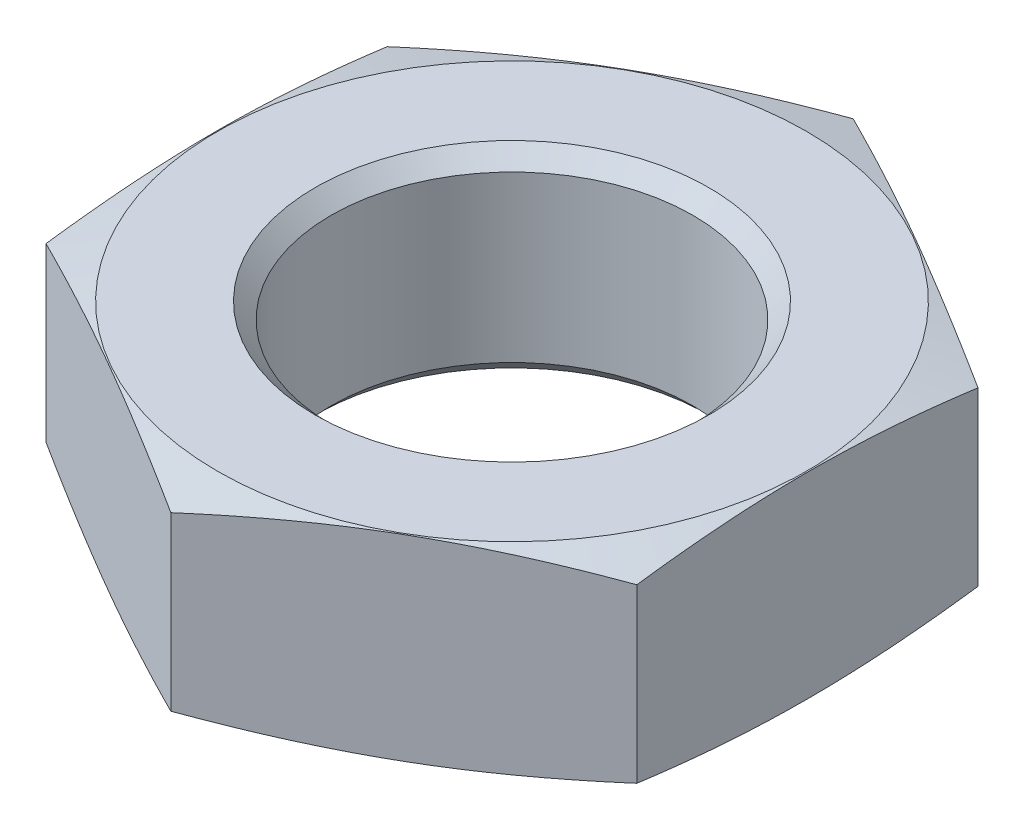
ISO-10303-21;
HEADER;
FILE_DESCRIPTION(('STEP AP214'),'2;1');
FILE_NAME('part.step','',(''),(''),'','','');
FILE_SCHEMA(('AUTOMOTIVE_DESIGN { 1 0 10303 214 1 1 1 1 }'));
ENDSEC;
DATA;
#1=APPLICATION_CONTEXT('core data for automotive mechanical design processes');
#2=APPLICATION_PROTOCOL_DEFINITION('international standard','automotive_design',2000,#1);
#3=PRODUCT_CONTEXT('',#1,'mechanical');
#4=PRODUCT('Part','Part','',(#3));
#5=PRODUCT_RELATED_PRODUCT_CATEGORY('part','',(#4));
#6=PRODUCT_DEFINITION_FORMATION('','',#4);
#7=PRODUCT_DEFINITION_CONTEXT('part definition',#1,'design');
#8=PRODUCT_DEFINITION('design','',#6,#7);
#9=PRODUCT_DEFINITION_SHAPE('','',#8);
#10=(LENGTH_UNIT() NAMED_UNIT(*) SI_UNIT(.MILLI.,.METRE.));
#11=(NAMED_UNIT(*) PLANE_ANGLE_UNIT() SI_UNIT($,.RADIAN.));
#12=(NAMED_UNIT(*) SI_UNIT($,.STERADIAN.) SOLID_ANGLE_UNIT());
#13=UNCERTAINTY_MEASURE_WITH_UNIT(LENGTH_MEASURE(1.E-05),#10,'distance_accuracy_value','');
#14=(GEOMETRIC_REPRESENTATION_CONTEXT(3) GLOBAL_UNCERTAINTY_ASSIGNED_CONTEXT((#13)) GLOBAL_UNIT_ASSIGNED_CONTEXT((#10,
#11,#12)) REPRESENTATION_CONTEXT('',''));
#15=CARTESIAN_POINT('',(0.,0.,0.));
#16=DIRECTION('',(0.,0.,1.));
#17=DIRECTION('',(1.,0.,0.));
#18=AXIS2_PLACEMENT_3D('',#15,#16,#17);
#19=CARTESIAN_POINT('',(0.,-5.,0.));
#20=DIRECTION('',(0.,-1.,0.));
#21=DIRECTION('',(0.,0.,-1.));
#22=AXIS2_PLACEMENT_3D('',#19,#20,#21);
#23=CONICAL_SURFACE('',#22,33.610254037844,1.30899693899574);
#24=CARTESIAN_POINT('',(0.,0.,0.));
#25=DIRECTION('',(0.,-1.,0.));
#26=DIRECTION('',(0.,0.,-1.));
#27=AXIS2_PLACEMENT_3D('',#24,#25,#26);
#28=CIRCLE('',#27,14.95);
#29=CARTESIAN_POINT('',(0.,0.,-14.95));
#30=VERTEX_POINT('',#29);
#31=EDGE_CURVE('E121',#30,#30,#28,.T.);
#32=ORIENTED_EDGE('',*,*,#31,.T.);
#33=EDGE_LOOP('',(#32));
#34=FACE_BOUND('',#33,.T.);
#35=CARTESIAN_POINT('',(0.000200000000000056,-0.635206664949411,-17.3206235457428));
#36=CARTESIAN_POINT('',(-0.622728932700655,-0.538800827945986,-16.9609753587621));
#37=CARTESIAN_POINT('',(-1.24678727017876,-0.451280393314875,-16.6006751096291));
#38=CARTESIAN_POINT('',(-2.49710774889726,-0.29751538584662,-15.8788022446676));
#39=CARTESIAN_POINT('',(-3.12337068110035,-0.231279453936855,-15.5172291721767));
#40=CARTESIAN_POINT('',(-4.37430350543358,-0.123950090522062,-14.7950027693097));
#41=CARTESIAN_POINT('',(-4.99896493964763,-0.0827286703296778,-14.4343543221139));
#42=CARTESIAN_POINT('',(-6.2490843675985,-0.0274549828941479,-13.7125975338672));
#43=CARTESIAN_POINT('',(-6.87454218379925,-0.0133974596215881,-13.351489295317));
#44=CARTESIAN_POINT('',(-8.12545781620075,-0.0133974596215824,-12.6292728182164));
#45=CARTESIAN_POINT('',(-8.75091563240149,-0.0274549828941366,-12.2681645796662));
#46=CARTESIAN_POINT('',(-10.0010350603524,-0.0827286703296557,-11.5464077914195));
#47=CARTESIAN_POINT('',(-10.6256964945664,-0.123950090522035,-11.1857593442237));
#48=CARTESIAN_POINT('',(-11.8766293188996,-0.231279453936818,-10.4635329413567));
#49=CARTESIAN_POINT('',(-12.5028922511027,-0.297515385846577,-10.1019598688658));
#50=CARTESIAN_POINT('',(-13.7532127298212,-0.451280393314823,-9.38008700390433));
#51=CARTESIAN_POINT('',(-14.3772710672993,-0.53880082794593,-9.0197867547713));
#52=CARTESIAN_POINT('',(-15.0002,-0.635206664949352,-8.66013856779056));
#53=B_SPLINE_CURVE_WITH_KNOTS('',3,(#35,#36,#37,#38,#39,#40,#41,#42,#43,#44,#45,#46,#47,#48,#49,
#50,#51,#52),.UNSPECIFIED.,.F.,.F.,(4,2,2,2,2,2,2,2,4),(0.,2.17729853341998,4.35547987718866,
6.52242029514905,8.68894138286617,10.8554624705833,13.0224028885437,15.2005842323124,
17.3778827657323),.UNSPECIFIED.);
#54=CARTESIAN_POINT('',(0.,-0.635175724532333,-17.320508075689));
#55=VERTEX_POINT('',#54);
#56=CARTESIAN_POINT('',(-15.,-0.635175724532275,-8.6602540378444));
#57=VERTEX_POINT('',#56);
#58=EDGE_CURVE('E117',#55,#57,#53,.T.);
#59=ORIENTED_EDGE('',*,*,#58,.T.);
#60=CARTESIAN_POINT('',(-15.,-4.19734686145317,-26.6882104151644));
#61=CARTESIAN_POINT('',(-15.,-4.04728237957778,-26.0456775069698));
#62=CARTESIAN_POINT('',(-15.,-3.89841376208704,-25.4028625682647));
#63=CARTESIAN_POINT('',(-15.,-3.60361331633755,-24.1165495457866));
#64=CARTESIAN_POINT('',(-15.,-3.45768153375547,-23.4730514515519));
#65=CARTESIAN_POINT('',(-15.,-3.16927895018258,-22.1851588287416));
#66=CARTESIAN_POINT('',(-15.,-3.02680876745556,-21.5407641614482));
#67=CARTESIAN_POINT('',(-15.,-2.74607458738785,-20.2510596723885));
#68=CARTESIAN_POINT('',(-15.,-2.60781057691053,-19.605749853487));
#69=CARTESIAN_POINT('',(-15.,-2.33504512118306,-18.3077216695585));
#70=CARTESIAN_POINT('',(-15.,-2.20059388847709,-17.6549927253798));
#71=CARTESIAN_POINT('',(-15.,-1.93803441364996,-16.348254444997));
#72=CARTESIAN_POINT('',(-15.,-1.80992618679957,-15.6942451057142));
#73=CARTESIAN_POINT('',(-15.,-1.56147605534191,-14.3846693484919));
#74=CARTESIAN_POINT('',(-15.,-1.44113503722143,-13.7291027616423));
#75=CARTESIAN_POINT('',(-15.,-1.21001623344559,-12.4162761806663));
#76=CARTESIAN_POINT('',(-15.,-1.09923844463331,-11.7590161870991));
#77=CARTESIAN_POINT('',(-15.,-0.892302321740734,-10.4607522997781));
#78=CARTESIAN_POINT('',(-15.,-0.795825238468954,-9.819799562115));
#79=CARTESIAN_POINT('',(-15.,-0.616291631949564,-8.53599965014025));
#80=CARTESIAN_POINT('',(-15.,-0.533235112731352,-7.89315247525991));
#81=CARTESIAN_POINT('',(-15.,-0.383133589787474,-6.60574537953739));
#82=CARTESIAN_POINT('',(-15.,-0.316084281466315,-5.96118596639323));
#83=CARTESIAN_POINT('',(-15.,-0.2005588921417,-4.67038988333616));
#84=CARTESIAN_POINT('',(-15.,-0.152082560600824,-4.02415323616645));
#85=CARTESIAN_POINT('',(-15.,-0.0761180684616546,-2.73338911847361));
#86=CARTESIAN_POINT('',(-15.,-0.0485350726589694,-2.08886731965157));
#87=CARTESIAN_POINT('',(-15.,-0.0154243686231671,-0.799251571457375));
#88=CARTESIAN_POINT('',(-15.,-0.00989652534641193,-0.154157625612663));
#89=CARTESIAN_POINT('',(-15.,-0.0212012472705901,1.13587343404143));
#90=CARTESIAN_POINT('',(-15.,-0.0380352393381742,1.78081053521643));
#91=CARTESIAN_POINT('',(-15.,-0.0931531405870201,3.06974525131756));
#92=CARTESIAN_POINT('',(-15.,-0.131437035434169,3.71374286687122));
#93=CARTESIAN_POINT('',(-15.,-0.249239500101832,5.28978420404424));
#94=CARTESIAN_POINT('',(-15.,-0.339561614299427,6.22102068218273));
#95=CARTESIAN_POINT('',(-15.,-0.553803128138935,8.07947744819296));
#96=CARTESIAN_POINT('',(-15.,-0.677721798777665,9.00669782276562));
#97=CARTESIAN_POINT('',(-15.,-0.951932633784524,10.8603845088264));
#98=CARTESIAN_POINT('',(-15.,-1.10231282697987,11.786837595432));
#99=CARTESIAN_POINT('',(-15.,-1.42269864392773,13.636289263484));
#100=CARTESIAN_POINT('',(-15.,-1.59270402317841,14.5592878878204));
#101=CARTESIAN_POINT('',(-15.,-1.95116249047242,16.4220380388751));
#102=CARTESIAN_POINT('',(-15.,-2.13993101489592,17.3617283910909));
#103=CARTESIAN_POINT('',(-15.,-2.52890919838184,19.2387360556124));
#104=CARTESIAN_POINT('',(-15.,-2.72911900124019,20.1760533379382));
#105=CARTESIAN_POINT('',(-15.,-3.1370044972446,22.0433826497276));
#106=CARTESIAN_POINT('',(-15.,-3.34463037516154,22.9734055987705));
#107=CARTESIAN_POINT('',(-15.,-3.66099034394533,24.3672843884216));
#108=CARTESIAN_POINT('',(-15.,-3.76726012093449,24.8317021000828));
#109=CARTESIAN_POINT('',(-15.,-3.9812567862345,25.7601995400648));
#110=CARTESIAN_POINT('',(-15.,-4.08898366782203,26.2242792699348));
#111=CARTESIAN_POINT('',(-15.,-4.19734686145317,26.6882104151644));
#112=B_SPLINE_CURVE_WITH_KNOTS('',3,(#60,#61,#62,#63,#64,#65,#66,#67,#68,#69,#70,#71,#72,#73,
#74,#75,#76,#77,#78,#79,#80,#81,#82,#83,#84,#85,#86,#87,#88,#89,#90,#91,#92,#93,#94,#95,#96,#97,
#98,#99,#100,#101,#102,#103,#104,#105,#106,#107,#108,#109,#110,#111),.UNSPECIFIED.,.F.,.F.,(4,2,
2,2,2,2,2,2,2,2,2,2,2,2,2,2,2,2,2,2,2,2,2,2,2,4),(0.,1.97947523238895,3.95898122786014,
5.93883821473682,7.9186890175283,9.91796086950209,11.9172375344847,13.9167419788133,
15.9162457630806,17.8606482285009,19.8050512777089,21.748930855315,23.6927842103219,
25.6277606188558,27.5627251795162,29.4978132125565,31.4328999524564,34.2388983241575,
37.0448358140818,39.8602905717607,42.6757102566727,45.5510054442523,48.4263367769824,
51.2850564287586,52.7143179876363,54.1435729538964),.UNSPECIFIED.);
#113=CARTESIAN_POINT('',(-15.,-0.635175724532275,8.6602540378444));
#114=VERTEX_POINT('',#113);
#115=EDGE_CURVE('E110',#57,#114,#112,.T.);
#116=ORIENTED_EDGE('',*,*,#115,.T.);
#117=CARTESIAN_POINT('',(-15.0002,-0.635206664949351,8.66013856779056));
#118=CARTESIAN_POINT('',(-14.3772710672993,-0.53880082794593,9.0197867547713));
#119=CARTESIAN_POINT('',(-13.7532127298212,-0.451280393314824,9.38008700390433));
#120=CARTESIAN_POINT('',(-12.5028922511027,-0.297515385846578,10.1019598688658));
#121=CARTESIAN_POINT('',(-11.8766293188996,-0.231279453936818,10.4635329413567));
#122=CARTESIAN_POINT('',(-10.6256964945664,-0.123950090522035,11.1857593442237));
#123=CARTESIAN_POINT('',(-10.0010350603524,-0.0827286703296557,11.5464077914195));
#124=CARTESIAN_POINT('',(-8.7509156324015,-0.0274549828941366,12.2681645796662));
#125=CARTESIAN_POINT('',(-8.12545781620075,-0.0133974596215823,12.6292728182164));
#126=CARTESIAN_POINT('',(-6.87454218379925,-0.0133974596215877,13.351489295317));
#127=CARTESIAN_POINT('',(-6.2490843675985,-0.0274549828941473,13.7125975338672));
#128=CARTESIAN_POINT('',(-4.99896493964764,-0.0827286703296775,14.4343543221139));
#129=CARTESIAN_POINT('',(-4.37430350543358,-0.123950090522062,14.7950027693097));
#130=CARTESIAN_POINT('',(-3.12337068110035,-0.231279453936855,15.5172291721767));
#131=CARTESIAN_POINT('',(-2.49710774889727,-0.297515385846619,15.8788022446676));
#132=CARTESIAN_POINT('',(-1.24678727017876,-0.451280393314873,16.6006751096291));
#133=CARTESIAN_POINT('',(-0.622728932700655,-0.538800827945984,16.9609753587621));
#134=CARTESIAN_POINT('',(0.000199999999999267,-0.635206664949409,17.3206235457428));
#135=B_SPLINE_CURVE_WITH_KNOTS('',3,(#117,#118,#119,#120,#121,#122,#123,#124,#125,#126,#127,
#128,#129,#130,#131,#132,#133,#134),.UNSPECIFIED.,.F.,.F.,(4,2,2,2,2,2,2,2,4),(0.,
2.17729853341998,4.35547987718866,6.52242029514905,8.68894138286617,10.8554624705833,
13.0224028885437,15.2005842323124,17.3778827657323),.UNSPECIFIED.);
#136=CARTESIAN_POINT('',(0.,-0.635175724532335,17.320508075689));
#137=VERTEX_POINT('',#136);
#138=EDGE_CURVE('E99',#114,#137,#135,.T.);
#139=ORIENTED_EDGE('',*,*,#138,.T.);
#140=CARTESIAN_POINT('',(-0.000200000000000798,-0.635206664949411,17.3206235457428));
#141=CARTESIAN_POINT('',(0.622728932700653,-0.538800827945984,16.9609753587621));
#142=CARTESIAN_POINT('',(1.24678727017876,-0.451280393314873,16.6006751096291));
#143=CARTESIAN_POINT('',(2.49710774889726,-0.297515385846619,15.8788022446676));
#144=CARTESIAN_POINT('',(3.12337068110035,-0.231279453936855,15.5172291721767));
#145=CARTESIAN_POINT('',(4.37430350543358,-0.123950090522062,14.7950027693097));
#146=CARTESIAN_POINT('',(4.99896493964763,-0.0827286703296774,14.4343543221139));
#147=CARTESIAN_POINT('',(6.2490843675985,-0.0274549828941471,13.7125975338672));
#148=CARTESIAN_POINT('',(6.87454218379925,-0.0133974596215877,13.351489295317));
#149=CARTESIAN_POINT('',(8.12545781620075,-0.0133974596215821,12.6292728182164));
#150=CARTESIAN_POINT('',(8.7509156324015,-0.027454982894136,12.2681645796662));
#151=CARTESIAN_POINT('',(10.0010350603524,-0.0827286703296551,11.5464077914195));
#152=CARTESIAN_POINT('',(10.6256964945664,-0.123950090522034,11.1857593442237));
#153=CARTESIAN_POINT('',(11.8766293188996,-0.231279453936818,10.4635329413567));
#154=CARTESIAN_POINT('',(12.5028922511027,-0.297515385846577,10.1019598688658));
#155=CARTESIAN_POINT('',(13.7532127298212,-0.451280393314823,9.38008700390433));
#156=CARTESIAN_POINT('',(14.3772710672993,-0.53880082794593,9.0197867547713));
#157=CARTESIAN_POINT('',(15.0002,-0.635206664949352,8.66013856779056));
#158=B_SPLINE_CURVE_WITH_KNOTS('',3,(#140,#141,#142,#143,#144,#145,#146,#147,#148,#149,#150,
#151,#152,#153,#154,#155,#156,#157),.UNSPECIFIED.,.F.,.F.,(4,2,2,2,2,2,2,2,4),(0.,
2.17729853341998,4.35547987718866,6.52242029514905,8.68894138286617,10.8554624705833,
13.0224028885437,15.2005842323124,17.3778827657323),.UNSPECIFIED.);
#159=CARTESIAN_POINT('',(15.,-0.635175724532275,8.6602540378444));
#160=VERTEX_POINT('',#159);
#161=EDGE_CURVE('E104',#137,#160,#158,.T.);
#162=ORIENTED_EDGE('',*,*,#161,.T.);
#163=CARTESIAN_POINT('',(15.,-4.19734686145317,26.6882104151644));
#164=CARTESIAN_POINT('',(15.,-4.04728237957778,26.0456775069698));
#165=CARTESIAN_POINT('',(15.,-3.89841376208704,25.4028625682647));
#166=CARTESIAN_POINT('',(15.,-3.60361331633755,24.1165495457866));
#167=CARTESIAN_POINT('',(15.,-3.45768153375547,23.4730514515519));
#168=CARTESIAN_POINT('',(15.,-3.16927895018258,22.1851588287416));
#169=CARTESIAN_POINT('',(15.,-3.02680876745556,21.5407641614482));
#170=CARTESIAN_POINT('',(15.,-2.74607458738785,20.2510596723885));
#171=CARTESIAN_POINT('',(15.,-2.60781057691053,19.605749853487));
#172=CARTESIAN_POINT('',(15.,-2.33504512118306,18.3077216695585));
#173=CARTESIAN_POINT('',(15.,-2.20059388847709,17.6549927253798));
#174=CARTESIAN_POINT('',(15.,-1.93803441364996,16.348254444997));
#175=CARTESIAN_POINT('',(15.,-1.80992618679957,15.6942451057142));
#176=CARTESIAN_POINT('',(15.,-1.56147605534191,14.3846693484919));
#177=CARTESIAN_POINT('',(15.,-1.44113503722143,13.7291027616423));
#178=CARTESIAN_POINT('',(15.,-1.21001623344559,12.4162761806663));
#179=CARTESIAN_POINT('',(15.,-1.09923844463331,11.7590161870991));
#180=CARTESIAN_POINT('',(15.,-0.892302321740734,10.4607522997781));
#181=CARTESIAN_POINT('',(15.,-0.795825238468954,9.819799562115));
#182=CARTESIAN_POINT('',(15.,-0.616291631949564,8.53599965014025));
#183=CARTESIAN_POINT('',(15.,-0.533235112731352,7.89315247525991));
#184=CARTESIAN_POINT('',(15.,-0.383133589787474,6.60574537953739));
#185=CARTESIAN_POINT('',(15.,-0.316084281466315,5.96118596639323));
#186=CARTESIAN_POINT('',(15.,-0.2005588921417,4.67038988333616));
#187=CARTESIAN_POINT('',(15.,-0.152082560600824,4.02415323616645));
#188=CARTESIAN_POINT('',(15.,-0.0761180684616546,2.73338911847361));
#189=CARTESIAN_POINT('',(15.,-0.0485350726589694,2.08886731965157));
#190=CARTESIAN_POINT('',(15.,-0.0154243686231671,0.799251571457375));
#191=CARTESIAN_POINT('',(15.,-0.00989652534641193,0.154157625612663));
#192=CARTESIAN_POINT('',(15.,-0.0212012472705901,-1.13587343404143));
#193=CARTESIAN_POINT('',(15.,-0.0380352393381742,-1.78081053521643));
#194=CARTESIAN_POINT('',(15.,-0.0931531405870201,-3.06974525131756));
#195=CARTESIAN_POINT('',(15.,-0.131437035434169,-3.71374286687122));
#196=CARTESIAN_POINT('',(15.,-0.249239500101832,-5.28978420404424));
#197=CARTESIAN_POINT('',(15.,-0.339561614299427,-6.22102068218273));
#198=CARTESIAN_POINT('',(15.,-0.553803128138935,-8.07947744819296));
#199=CARTESIAN_POINT('',(15.,-0.677721798777665,-9.00669782276562));
#200=CARTESIAN_POINT('',(15.,-0.951932633784524,-10.8603845088264));
#201=CARTESIAN_POINT('',(15.,-1.10231282697987,-11.786837595432));
#202=CARTESIAN_POINT('',(15.,-1.42269864392773,-13.636289263484));
#203=CARTESIAN_POINT('',(15.,-1.59270402317841,-14.5592878878204));
#204=CARTESIAN_POINT('',(15.,-1.95116249047242,-16.4220380388751));
#205=CARTESIAN_POINT('',(15.,-2.13993101489592,-17.3617283910909));
#206=CARTESIAN_POINT('',(15.,-2.52890919838184,-19.2387360556124));
#207=CARTESIAN_POINT('',(15.,-2.72911900124019,-20.1760533379382));
#208=CARTESIAN_POINT('',(15.,-3.1370044972446,-22.0433826497276));
#209=CARTESIAN_POINT('',(15.,-3.34463037516154,-22.9734055987705));
#210=CARTESIAN_POINT('',(15.,-3.66099034394533,-24.3672843884216));
#211=CARTESIAN_POINT('',(15.,-3.76726012093449,-24.8317021000828));
#212=CARTESIAN_POINT('',(15.,-3.9812567862345,-25.7601995400648));
#213=CARTESIAN_POINT('',(15.,-4.08898366782203,-26.2242792699348));
#214=CARTESIAN_POINT('',(15.,-4.19734686145317,-26.6882104151644));
#215=B_SPLINE_CURVE_WITH_KNOTS('',3,(#163,#164,#165,#166,#167,#168,#169,#170,#171,#172,#173,
#174,#175,#176,#177,#178,#179,#180,#181,#182,#183,#184,#185,#186,#187,#188,#189,#190,#191,#192,
#193,#194,#195,#196,#197,#198,#199,#200,#201,#202,#203,#204,#205,#206,#207,#208,#209,#210,#211,
#212,#213,#214),.UNSPECIFIED.,.F.,.F.,(4,2,2,2,2,2,2,2,2,2,2,2,2,2,2,2,2,2,2,2,2,2,2,2,2,4),(0.,
1.97947523238895,3.95898122786014,5.93883821473682,7.9186890175283,9.91796086950209,
11.9172375344847,13.9167419788133,15.9162457630806,17.8606482285009,19.8050512777089,
21.748930855315,23.6927842103219,25.6277606188558,27.5627251795162,29.4978132125565,
31.4328999524564,34.2388983241575,37.0448358140818,39.8602905717607,42.6757102566727,
45.5510054442523,48.4263367769824,51.2850564287586,52.7143179876363,54.1435729538964),.UNSPECIFIED.);
#216=CARTESIAN_POINT('',(15.,-0.635175724532275,-8.6602540378444));
#217=VERTEX_POINT('',#216);
#218=EDGE_CURVE('E207',#160,#217,#215,.T.);
#219=ORIENTED_EDGE('',*,*,#218,.T.);
#220=CARTESIAN_POINT('',(15.0002,-0.635206664949351,-8.66013856779056));
#221=CARTESIAN_POINT('',(14.3772710672993,-0.53880082794593,-9.0197867547713));
#222=CARTESIAN_POINT('',(13.7532127298212,-0.451280393314824,-9.38008700390433));
#223=CARTESIAN_POINT('',(12.5028922511027,-0.297515385846578,-10.1019598688658));
#224=CARTESIAN_POINT('',(11.8766293188996,-0.231279453936818,-10.4635329413567));
#225=CARTESIAN_POINT('',(10.6256964945664,-0.123950090522035,-11.1857593442237));
#226=CARTESIAN_POINT('',(10.0010350603524,-0.0827286703296557,-11.5464077914195));
#227=CARTESIAN_POINT('',(8.7509156324015,-0.0274549828941366,-12.2681645796662));
#228=CARTESIAN_POINT('',(8.12545781620075,-0.0133974596215823,-12.6292728182164));
#229=CARTESIAN_POINT('',(6.87454218379925,-0.0133974596215877,-13.351489295317));
#230=CARTESIAN_POINT('',(6.2490843675985,-0.0274549828941473,-13.7125975338672));
#231=CARTESIAN_POINT('',(4.99896493964764,-0.0827286703296775,-14.4343543221139));
#232=CARTESIAN_POINT('',(4.37430350543358,-0.123950090522062,-14.7950027693097));
#233=CARTESIAN_POINT('',(3.12337068110035,-0.231279453936855,-15.5172291721767));
#234=CARTESIAN_POINT('',(2.49710774889727,-0.297515385846619,-15.8788022446676));
#235=CARTESIAN_POINT('',(1.24678727017876,-0.451280393314873,-16.6006751096291));
#236=CARTESIAN_POINT('',(0.622728932700655,-0.538800827945984,-16.9609753587621));
#237=CARTESIAN_POINT('',(-0.000199999999999267,-0.635206664949409,-17.3206235457428));
#238=B_SPLINE_CURVE_WITH_KNOTS('',3,(#220,#221,#222,#223,#224,#225,#226,#227,#228,#229,#230,
#231,#232,#233,#234,#235,#236,#237),.UNSPECIFIED.,.F.,.F.,(4,2,2,2,2,2,2,2,4),(0.,
2.17729853341998,4.35547987718866,6.52242029514905,8.68894138286617,10.8554624705833,
13.0224028885437,15.2005842323124,17.3778827657323),.UNSPECIFIED.);
#239=EDGE_CURVE('E123',#217,#55,#238,.T.);
#240=ORIENTED_EDGE('',*,*,#239,.T.);
#241=EDGE_LOOP('',(#59,#116,#139,#162,#219,#240));
#242=FACE_BOUND('',#241,.T.);
#243=ADVANCED_FACE('F43',(#34,#242),#23,.T.);
#244=CARTESIAN_POINT('',(0.,0.,0.));
#245=DIRECTION('',(0.,1.,0.));
#246=DIRECTION('',(0.,0.,1.));
#247=AXIS2_PLACEMENT_3D('',#244,#245,#246);
#248=PLANE('',#247);
#249=CARTESIAN_POINT('',(0.,0.,0.));
#250=DIRECTION('',(0.,1.,0.));
#251=DIRECTION('',(0.,0.,1.));
#252=AXIS2_PLACEMENT_3D('',#249,#250,#251);
#253=CIRCLE('',#252,10.);
#254=CARTESIAN_POINT('',(0.,0.,10.));
#255=VERTEX_POINT('',#254);
#256=EDGE_CURVE('E113',#255,#255,#253,.T.);
#257=ORIENTED_EDGE('',*,*,#256,.F.);
#258=EDGE_LOOP('',(#257));
#259=FACE_BOUND('',#258,.T.);
#260=ORIENTED_EDGE('',*,*,#31,.F.);
#261=EDGE_LOOP('',(#260));
#262=FACE_BOUND('',#261,.T.);
#263=ADVANCED_FACE('F45',(#259,#262),#248,.T.);
#264=CARTESIAN_POINT('',(-15.,-11.,-8.6602540378444));
#265=DIRECTION('',(-1.,0.,0.));
#266=DIRECTION('',(0.,0.,1.));
#267=AXIS2_PLACEMENT_3D('',#264,#265,#266);
#268=PLANE('',#267);
#269=DIRECTION('',(0.,1.,0.));
#270=VECTOR('',#269,1.);
#271=CARTESIAN_POINT('',(-15.,-11.,-8.6602540378444));
#272=LINE('',#271,#270);
#273=CARTESIAN_POINT('',(-15.,-9.36482427546772,-8.6602540378444));
#274=VERTEX_POINT('',#273);
#275=EDGE_CURVE('E105',#274,#57,#272,.T.);
#276=ORIENTED_EDGE('',*,*,#275,.F.);
#277=CARTESIAN_POINT('',(-15.,-5.80265313854684,26.6882104151644));
#278=CARTESIAN_POINT('',(-15.,-5.95271762042223,26.0456775069698));
#279=CARTESIAN_POINT('',(-15.,-6.10158623791296,25.4028625682647));
#280=CARTESIAN_POINT('',(-15.,-6.39638668366245,24.1165495457866));
#281=CARTESIAN_POINT('',(-15.,-6.54231846624453,23.4730514515519));
#282=CARTESIAN_POINT('',(-15.,-6.83072104981742,22.1851588287416));
#283=CARTESIAN_POINT('',(-15.,-6.97319123254444,21.5407641614482));
#284=CARTESIAN_POINT('',(-15.,-7.25392541261215,20.2510596723885));
#285=CARTESIAN_POINT('',(-15.,-7.39218942308948,19.605749853487));
#286=CARTESIAN_POINT('',(-15.,-7.66495487881695,18.3077216695585));
#287=CARTESIAN_POINT('',(-15.,-7.79940611152291,17.6549927253798));
#288=CARTESIAN_POINT('',(-15.,-8.06196558635004,16.348254444997));
#289=CARTESIAN_POINT('',(-15.,-8.19007381320043,15.6942451057142));
#290=CARTESIAN_POINT('',(-15.,-8.43852394465809,14.3846693484919));
#291=CARTESIAN_POINT('',(-15.,-8.55886496277857,13.7291027616423));
#292=CARTESIAN_POINT('',(-15.,-8.78998376655441,12.4162761806663));
#293=CARTESIAN_POINT('',(-15.,-8.90076155536669,11.7590161870991));
#294=CARTESIAN_POINT('',(-15.,-9.10769767825927,10.4607522997781));
#295=CARTESIAN_POINT('',(-15.,-9.20417476153105,9.819799562115));
#296=CARTESIAN_POINT('',(-15.,-9.38370836805044,8.53599965014025));
#297=CARTESIAN_POINT('',(-15.,-9.46676488726865,7.89315247525991));
#298=CARTESIAN_POINT('',(-15.,-9.61686641021253,6.60574537953739));
#299=CARTESIAN_POINT('',(-15.,-9.68391571853368,5.96118596639323));
#300=CARTESIAN_POINT('',(-15.,-9.7994411078583,4.67038988333616));
#301=CARTESIAN_POINT('',(-15.,-9.84791743939918,4.02415323616644));
#302=CARTESIAN_POINT('',(-15.,-9.92388193153835,2.73338911847361));
#303=CARTESIAN_POINT('',(-15.,-9.95146492734103,2.08886731965157));
#304=CARTESIAN_POINT('',(-15.,-9.98457563137683,0.799251571457373));
#305=CARTESIAN_POINT('',(-15.,-9.99010347465359,0.154157625612662));
#306=CARTESIAN_POINT('',(-15.,-9.97879875272941,-1.13587343404143));
#307=CARTESIAN_POINT('',(-15.,-9.96196476066183,-1.78081053521643));
#308=CARTESIAN_POINT('',(-15.,-9.90684685941298,-3.06974525131756));
#309=CARTESIAN_POINT('',(-15.,-9.86856296456583,-3.71374286687122));
#310=CARTESIAN_POINT('',(-15.,-9.75076049989817,-5.28978420404424));
#311=CARTESIAN_POINT('',(-15.,-9.66043838570057,-6.22102068218273));
#312=CARTESIAN_POINT('',(-15.,-9.44619687186106,-8.07947744819296));
#313=CARTESIAN_POINT('',(-15.,-9.32227820122234,-9.00669782276562));
#314=CARTESIAN_POINT('',(-15.,-9.04806736621548,-10.8603845088264));
#315=CARTESIAN_POINT('',(-15.,-8.89768717302013,-11.786837595432));
#316=CARTESIAN_POINT('',(-15.,-8.57730135607227,-13.636289263484));
#317=CARTESIAN_POINT('',(-15.,-8.40729597682159,-14.5592878878204));
#318=CARTESIAN_POINT('',(-15.,-8.04883750952758,-16.4220380388751));
#319=CARTESIAN_POINT('',(-15.,-7.86006898510408,-17.3617283910909));
#320=CARTESIAN_POINT('',(-15.,-7.47109080161816,-19.2387360556124));
#321=CARTESIAN_POINT('',(-15.,-7.27088099875981,-20.1760533379382));
#322=CARTESIAN_POINT('',(-15.,-6.86299550275541,-22.0433826497276));
#323=CARTESIAN_POINT('',(-15.,-6.65536962483846,-22.9734055987705));
#324=CARTESIAN_POINT('',(-15.,-6.33900965605468,-24.3672843884216));
#325=CARTESIAN_POINT('',(-15.,-6.23273987906552,-24.8317021000828));
#326=CARTESIAN_POINT('',(-15.,-6.0187432137655,-25.7601995400648));
#327=CARTESIAN_POINT('',(-15.,-5.91101633217798,-26.2242792699348));
#328=CARTESIAN_POINT('',(-15.,-5.80265313854683,-26.6882104151644));
#329=B_SPLINE_CURVE_WITH_KNOTS('',3,(#277,#278,#279,#280,#281,#282,#283,#284,#285,#286,#287,
#288,#289,#290,#291,#292,#293,#294,#295,#296,#297,#298,#299,#300,#301,#302,#303,#304,#305,#306,
#307,#308,#309,#310,#311,#312,#313,#314,#315,#316,#317,#318,#319,#320,#321,#322,#323,#324,#325,
#326,#327,#328),.UNSPECIFIED.,.F.,.F.,(4,2,2,2,2,2,2,2,2,2,2,2,2,2,2,2,2,2,2,2,2,2,2,2,2,4),(0.,
1.97947523238895,3.95898122786014,5.93883821473682,7.9186890175283,9.91796086950209,
11.9172375344847,13.9167419788133,15.9162457630806,17.8606482285009,19.8050512777089,
21.748930855315,23.6927842103219,25.6277606188558,27.5627251795162,29.4978132125565,
31.4328999524564,34.2388983241575,37.0448358140818,39.8602905717607,42.6757102566727,
45.5510054442523,48.4263367769824,51.2850564287586,52.7143179876363,54.1435729538964),.UNSPECIFIED.);
#330=CARTESIAN_POINT('',(-15.,-9.36482427546772,8.6602540378444));
#331=VERTEX_POINT('',#330);
#332=EDGE_CURVE('E11',#331,#274,#329,.T.);
#333=ORIENTED_EDGE('',*,*,#332,.F.);
#334=DIRECTION('',(0.,1.,0.));
#335=VECTOR('',#334,1.);
#336=CARTESIAN_POINT('',(-15.,-11.,8.6602540378444));
#337=LINE('',#336,#335);
#338=EDGE_CURVE('E69',#331,#114,#337,.T.);
#339=ORIENTED_EDGE('',*,*,#338,.T.);
#340=ORIENTED_EDGE('',*,*,#115,.F.);
#341=EDGE_LOOP('',(#276,#333,#339,#340));
#342=FACE_BOUND('',#341,.T.);
#343=ADVANCED_FACE('F109',(#342),#268,.T.);
#344=CARTESIAN_POINT('',(0.,-11.,-17.320508075689));
#345=DIRECTION('',(-0.500000000000009,0.,-0.866025403784433));
#346=DIRECTION('',(-0.866025403784433,0.,0.500000000000009));
#347=AXIS2_PLACEMENT_3D('',#344,#345,#346);
#348=PLANE('',#347);
#349=DIRECTION('',(0.,1.,0.));
#350=VECTOR('',#349,1.);
#351=CARTESIAN_POINT('',(0.,-11.,-17.320508075689));
#352=LINE('',#351,#350);
#353=CARTESIAN_POINT('',(0.,-9.36482427546767,-17.320508075689));
#354=VERTEX_POINT('',#353);
#355=EDGE_CURVE('E248',#354,#55,#352,.T.);
#356=ORIENTED_EDGE('',*,*,#355,.F.);
#357=CARTESIAN_POINT('',(-15.0002,-9.36479333505065,-8.66013856779056));
#358=CARTESIAN_POINT('',(-14.3772710672993,-9.46119917205407,-9.0197867547713));
#359=CARTESIAN_POINT('',(-13.7532127298212,-9.54871960668518,-9.38008700390433));
#360=CARTESIAN_POINT('',(-12.5028922511027,-9.70248461415342,-10.1019598688658));
#361=CARTESIAN_POINT('',(-11.8766293188996,-9.76872054606318,-10.4635329413567));
#362=CARTESIAN_POINT('',(-10.6256964945664,-9.87604990947797,-11.1857593442237));
#363=CARTESIAN_POINT('',(-10.0010350603524,-9.91727132967035,-11.5464077914195));
#364=CARTESIAN_POINT('',(-8.75091563240149,-9.97254501710587,-12.2681645796662));
#365=CARTESIAN_POINT('',(-8.12545781620075,-9.98660254037842,-12.6292728182164));
#366=CARTESIAN_POINT('',(-6.87454218379925,-9.98660254037841,-13.351489295317));
#367=CARTESIAN_POINT('',(-6.2490843675985,-9.97254501710585,-13.7125975338672));
#368=CARTESIAN_POINT('',(-4.99896493964764,-9.91727132967032,-14.4343543221139));
#369=CARTESIAN_POINT('',(-4.37430350543358,-9.87604990947794,-14.7950027693097));
#370=CARTESIAN_POINT('',(-3.12337068110035,-9.76872054606315,-15.5172291721767));
#371=CARTESIAN_POINT('',(-2.49710774889726,-9.70248461415338,-15.8788022446676));
#372=CARTESIAN_POINT('',(-1.24678727017876,-9.54871960668513,-16.6006751096291));
#373=CARTESIAN_POINT('',(-0.622728932700654,-9.46119917205401,-16.9609753587621));
#374=CARTESIAN_POINT('',(0.000199999999999776,-9.36479333505059,-17.3206235457428));
#375=B_SPLINE_CURVE_WITH_KNOTS('',3,(#357,#358,#359,#360,#361,#362,#363,#364,#365,#366,#367,
#368,#369,#370,#371,#372,#373,#374),.UNSPECIFIED.,.F.,.F.,(4,2,2,2,2,2,2,2,4),(0.,
2.17729853341998,4.35547987718866,6.52242029514906,8.68894138286617,10.8554624705833,
13.0224028885437,15.2005842323124,17.3778827657323),.UNSPECIFIED.);
#376=EDGE_CURVE('E57',#274,#354,#375,.T.);
#377=ORIENTED_EDGE('',*,*,#376,.F.);
#378=ORIENTED_EDGE('',*,*,#275,.T.);
#379=ORIENTED_EDGE('',*,*,#58,.F.);
#380=EDGE_LOOP('',(#356,#377,#378,#379));
#381=FACE_BOUND('',#380,.T.);
#382=ADVANCED_FACE('F141',(#381),#348,.T.);
#383=CARTESIAN_POINT('',(15.,-11.,-8.6602540378444));
#384=DIRECTION('',(0.500000000000009,0.,-0.866025403784433));
#385=DIRECTION('',(-0.866025403784433,0.,-0.500000000000009));
#386=AXIS2_PLACEMENT_3D('',#383,#384,#385);
#387=PLANE('',#386);
#388=DIRECTION('',(0.,1.,0.));
#389=VECTOR('',#388,1.);
#390=CARTESIAN_POINT('',(15.,-11.,-8.6602540378444));
#391=LINE('',#390,#389);
#392=CARTESIAN_POINT('',(15.,-9.36482427546772,-8.6602540378444));
#393=VERTEX_POINT('',#392);
#394=EDGE_CURVE('E250',#393,#217,#391,.T.);
#395=ORIENTED_EDGE('',*,*,#394,.F.);
#396=CARTESIAN_POINT('',(-0.000200000000001196,-9.36479333505059,-17.3206235457428));
#397=CARTESIAN_POINT('',(0.622728932700652,-9.46119917205401,-16.9609753587621));
#398=CARTESIAN_POINT('',(1.24678727017876,-9.54871960668513,-16.6006751096291));
#399=CARTESIAN_POINT('',(2.49710774889726,-9.70248461415338,-15.8788022446676));
#400=CARTESIAN_POINT('',(3.12337068110035,-9.76872054606315,-15.5172291721767));
#401=CARTESIAN_POINT('',(4.37430350543358,-9.87604990947794,-14.7950027693097));
#402=CARTESIAN_POINT('',(4.99896493964763,-9.91727132967032,-14.4343543221139));
#403=CARTESIAN_POINT('',(6.2490843675985,-9.97254501710585,-13.7125975338672));
#404=CARTESIAN_POINT('',(6.87454218379925,-9.98660254037841,-13.351489295317));
#405=CARTESIAN_POINT('',(8.12545781620075,-9.98660254037842,-12.6292728182164));
#406=CARTESIAN_POINT('',(8.7509156324015,-9.97254501710587,-12.2681645796662));
#407=CARTESIAN_POINT('',(10.0010350603524,-9.91727132967035,-11.5464077914195));
#408=CARTESIAN_POINT('',(10.6256964945664,-9.87604990947797,-11.1857593442237));
#409=CARTESIAN_POINT('',(11.8766293188996,-9.76872054606318,-10.4635329413567));
#410=CARTESIAN_POINT('',(12.5028922511027,-9.70248461415342,-10.1019598688658));
#411=CARTESIAN_POINT('',(13.7532127298212,-9.54871960668518,-9.38008700390433));
#412=CARTESIAN_POINT('',(14.3772710672993,-9.46119917205407,-9.0197867547713));
#413=CARTESIAN_POINT('',(15.0002,-9.36479333505065,-8.66013856779056));
#414=B_SPLINE_CURVE_WITH_KNOTS('',3,(#396,#397,#398,#399,#400,#401,#402,#403,#404,#405,#406,
#407,#408,#409,#410,#411,#412,#413),.UNSPECIFIED.,.F.,.F.,(4,2,2,2,2,2,2,2,4),(0.,
2.17729853341998,4.35547987718866,6.52242029514905,8.68894138286617,10.8554624705833,
13.0224028885437,15.2005842323124,17.3778827657323),.UNSPECIFIED.);
#415=EDGE_CURVE('E178',#354,#393,#414,.T.);
#416=ORIENTED_EDGE('',*,*,#415,.F.);
#417=ORIENTED_EDGE('',*,*,#355,.T.);
#418=ORIENTED_EDGE('',*,*,#239,.F.);
#419=EDGE_LOOP('',(#395,#416,#417,#418));
#420=FACE_BOUND('',#419,.T.);
#421=ADVANCED_FACE('F192',(#420),#387,.T.);
#422=CARTESIAN_POINT('',(15.,-11.,8.6602540378444));
#423=DIRECTION('',(1.,0.,0.));
#424=DIRECTION('',(0.,0.,-1.));
#425=AXIS2_PLACEMENT_3D('',#422,#423,#424);
#426=PLANE('',#425);
#427=DIRECTION('',(0.,1.,0.));
#428=VECTOR('',#427,1.);
#429=CARTESIAN_POINT('',(15.,-11.,8.6602540378444));
#430=LINE('',#429,#428);
#431=CARTESIAN_POINT('',(15.,-9.36482427546772,8.6602540378444));
#432=VERTEX_POINT('',#431);
#433=EDGE_CURVE('E253',#432,#160,#430,.T.);
#434=ORIENTED_EDGE('',*,*,#433,.F.);
#435=CARTESIAN_POINT('',(15.,-5.80265313854684,-26.6882104151644));
#436=CARTESIAN_POINT('',(15.,-5.95271762042223,-26.0456775069698));
#437=CARTESIAN_POINT('',(15.,-6.10158623791296,-25.4028625682647));
#438=CARTESIAN_POINT('',(15.,-6.39638668366245,-24.1165495457866));
#439=CARTESIAN_POINT('',(15.,-6.54231846624453,-23.4730514515519));
#440=CARTESIAN_POINT('',(15.,-6.83072104981742,-22.1851588287416));
#441=CARTESIAN_POINT('',(15.,-6.97319123254444,-21.5407641614482));
#442=CARTESIAN_POINT('',(15.,-7.25392541261215,-20.2510596723885));
#443=CARTESIAN_POINT('',(15.,-7.39218942308948,-19.605749853487));
#444=CARTESIAN_POINT('',(15.,-7.66495487881695,-18.3077216695585));
#445=CARTESIAN_POINT('',(15.,-7.79940611152291,-17.6549927253798));
#446=CARTESIAN_POINT('',(15.,-8.06196558635004,-16.348254444997));
#447=CARTESIAN_POINT('',(15.,-8.19007381320043,-15.6942451057142));
#448=CARTESIAN_POINT('',(15.,-8.43852394465809,-14.3846693484919));
#449=CARTESIAN_POINT('',(15.,-8.55886496277857,-13.7291027616423));
#450=CARTESIAN_POINT('',(15.,-8.78998376655441,-12.4162761806663));
#451=CARTESIAN_POINT('',(15.,-8.90076155536669,-11.7590161870991));
#452=CARTESIAN_POINT('',(15.,-9.10769767825927,-10.4607522997781));
#453=CARTESIAN_POINT('',(15.,-9.20417476153105,-9.819799562115));
#454=CARTESIAN_POINT('',(15.,-9.38370836805044,-8.53599965014025));
#455=CARTESIAN_POINT('',(15.,-9.46676488726865,-7.89315247525991));
#456=CARTESIAN_POINT('',(15.,-9.61686641021253,-6.60574537953739));
#457=CARTESIAN_POINT('',(15.,-9.68391571853368,-5.96118596639323));
#458=CARTESIAN_POINT('',(15.,-9.7994411078583,-4.67038988333616));
#459=CARTESIAN_POINT('',(15.,-9.84791743939918,-4.02415323616644));
#460=CARTESIAN_POINT('',(15.,-9.92388193153835,-2.73338911847361));
#461=CARTESIAN_POINT('',(15.,-9.95146492734103,-2.08886731965157));
#462=CARTESIAN_POINT('',(15.,-9.98457563137683,-0.799251571457373));
#463=CARTESIAN_POINT('',(15.,-9.99010347465359,-0.154157625612662));
#464=CARTESIAN_POINT('',(15.,-9.97879875272941,1.13587343404143));
#465=CARTESIAN_POINT('',(15.,-9.96196476066183,1.78081053521643));
#466=CARTESIAN_POINT('',(15.,-9.90684685941298,3.06974525131756));
#467=CARTESIAN_POINT('',(15.,-9.86856296456583,3.71374286687122));
#468=CARTESIAN_POINT('',(15.,-9.75076049989817,5.28978420404424));
#469=CARTESIAN_POINT('',(15.,-9.66043838570057,6.22102068218273));
#470=CARTESIAN_POINT('',(15.,-9.44619687186106,8.07947744819296));
#471=CARTESIAN_POINT('',(15.,-9.32227820122234,9.00669782276562));
#472=CARTESIAN_POINT('',(15.,-9.04806736621548,10.8603845088264));
#473=CARTESIAN_POINT('',(15.,-8.89768717302013,11.786837595432));
#474=CARTESIAN_POINT('',(15.,-8.57730135607227,13.636289263484));
#475=CARTESIAN_POINT('',(15.,-8.40729597682159,14.5592878878204));
#476=CARTESIAN_POINT('',(15.,-8.04883750952758,16.4220380388751));
#477=CARTESIAN_POINT('',(15.,-7.86006898510408,17.3617283910909));
#478=CARTESIAN_POINT('',(15.,-7.47109080161816,19.2387360556124));
#479=CARTESIAN_POINT('',(15.,-7.27088099875981,20.1760533379382));
#480=CARTESIAN_POINT('',(15.,-6.86299550275541,22.0433826497276));
#481=CARTESIAN_POINT('',(15.,-6.65536962483846,22.9734055987705));
#482=CARTESIAN_POINT('',(15.,-6.33900965605468,24.3672843884216));
#483=CARTESIAN_POINT('',(15.,-6.23273987906552,24.8317021000828));
#484=CARTESIAN_POINT('',(15.,-6.0187432137655,25.7601995400648));
#485=CARTESIAN_POINT('',(15.,-5.91101633217798,26.2242792699348));
#486=CARTESIAN_POINT('',(15.,-5.80265313854683,26.6882104151644));
#487=B_SPLINE_CURVE_WITH_KNOTS('',3,(#435,#436,#437,#438,#439,#440,#441,#442,#443,#444,#445,
#446,#447,#448,#449,#450,#451,#452,#453,#454,#455,#456,#457,#458,#459,#460,#461,#462,#463,#464,
#465,#466,#467,#468,#469,#470,#471,#472,#473,#474,#475,#476,#477,#478,#479,#480,#481,#482,#483,
#484,#485,#486),.UNSPECIFIED.,.F.,.F.,(4,2,2,2,2,2,2,2,2,2,2,2,2,2,2,2,2,2,2,2,2,2,2,2,2,4),(0.,
1.97947523238895,3.95898122786014,5.93883821473682,7.9186890175283,9.91796086950209,
11.9172375344847,13.9167419788133,15.9162457630806,17.8606482285009,19.8050512777089,
21.748930855315,23.6927842103219,25.6277606188558,27.5627251795162,29.4978132125565,
31.4328999524564,34.2388983241575,37.0448358140818,39.8602905717607,42.6757102566727,
45.5510054442523,48.4263367769824,51.2850564287586,52.7143179876363,54.1435729538964),.UNSPECIFIED.);
#488=EDGE_CURVE('E171',#393,#432,#487,.T.);
#489=ORIENTED_EDGE('',*,*,#488,.F.);
#490=ORIENTED_EDGE('',*,*,#394,.T.);
#491=ORIENTED_EDGE('',*,*,#218,.F.);
#492=EDGE_LOOP('',(#434,#489,#490,#491));
#493=FACE_BOUND('',#492,.T.);
#494=ADVANCED_FACE('F198',(#493),#426,.T.);
#495=CARTESIAN_POINT('',(0.,-11.,17.320508075689));
#496=DIRECTION('',(0.500000000000009,0.,0.866025403784433));
#497=DIRECTION('',(0.866025403784433,0.,-0.500000000000009));
#498=AXIS2_PLACEMENT_3D('',#495,#496,#497);
#499=PLANE('',#498);
#500=DIRECTION('',(0.,1.,0.));
#501=VECTOR('',#500,1.);
#502=CARTESIAN_POINT('',(0.,-11.,17.320508075689));
#503=LINE('',#502,#501);
#504=CARTESIAN_POINT('',(0.,-9.36482427546767,17.320508075689));
#505=VERTEX_POINT('',#504);
#506=EDGE_CURVE('E64',#505,#137,#503,.T.);
#507=ORIENTED_EDGE('',*,*,#506,.F.);
#508=CARTESIAN_POINT('',(15.0002,-9.36479333505065,8.66013856779056));
#509=CARTESIAN_POINT('',(14.3772710672993,-9.46119917205407,9.0197867547713));
#510=CARTESIAN_POINT('',(13.7532127298212,-9.54871960668518,9.38008700390433));
#511=CARTESIAN_POINT('',(12.5028922511027,-9.70248461415342,10.1019598688658));
#512=CARTESIAN_POINT('',(11.8766293188996,-9.76872054606318,10.4635329413567));
#513=CARTESIAN_POINT('',(10.6256964945664,-9.87604990947797,11.1857593442237));
#514=CARTESIAN_POINT('',(10.0010350603524,-9.91727132967035,11.5464077914195));
#515=CARTESIAN_POINT('',(8.75091563240149,-9.97254501710587,12.2681645796662));
#516=CARTESIAN_POINT('',(8.12545781620075,-9.98660254037842,12.6292728182164));
#517=CARTESIAN_POINT('',(6.87454218379925,-9.98660254037841,13.351489295317));
#518=CARTESIAN_POINT('',(6.2490843675985,-9.97254501710585,13.7125975338672));
#519=CARTESIAN_POINT('',(4.99896493964764,-9.91727132967032,14.4343543221139));
#520=CARTESIAN_POINT('',(4.37430350543358,-9.87604990947794,14.7950027693097));
#521=CARTESIAN_POINT('',(3.12337068110035,-9.76872054606315,15.5172291721767));
#522=CARTESIAN_POINT('',(2.49710774889726,-9.70248461415338,15.8788022446676));
#523=CARTESIAN_POINT('',(1.24678727017876,-9.54871960668513,16.6006751096291));
#524=CARTESIAN_POINT('',(0.622728932700654,-9.46119917205401,16.9609753587621));
#525=CARTESIAN_POINT('',(-0.000199999999999776,-9.36479333505059,17.3206235457428));
#526=B_SPLINE_CURVE_WITH_KNOTS('',3,(#508,#509,#510,#511,#512,#513,#514,#515,#516,#517,#518,
#519,#520,#521,#522,#523,#524,#525),.UNSPECIFIED.,.F.,.F.,(4,2,2,2,2,2,2,2,4),(0.,
2.17729853341998,4.35547987718866,6.52242029514906,8.68894138286617,10.8554624705833,
13.0224028885437,15.2005842323124,17.3778827657323),.UNSPECIFIED.);
#527=EDGE_CURVE('E164',#432,#505,#526,.T.);
#528=ORIENTED_EDGE('',*,*,#527,.F.);
#529=ORIENTED_EDGE('',*,*,#433,.T.);
#530=ORIENTED_EDGE('',*,*,#161,.F.);
#531=EDGE_LOOP('',(#507,#528,#529,#530));
#532=FACE_BOUND('',#531,.T.);
#533=ADVANCED_FACE('F222',(#532),#499,.T.);
#534=CARTESIAN_POINT('',(-15.,-11.,8.6602540378444));
#535=DIRECTION('',(-0.500000000000009,0.,0.866025403784433));
#536=DIRECTION('',(0.866025403784433,0.,0.500000000000009));
#537=AXIS2_PLACEMENT_3D('',#534,#535,#536);
#538=PLANE('',#537);
#539=ORIENTED_EDGE('',*,*,#338,.F.);
#540=CARTESIAN_POINT('',(0.000200000000000329,-9.36479333505059,17.3206235457428));
#541=CARTESIAN_POINT('',(-0.622728932700652,-9.46119917205401,16.9609753587621));
#542=CARTESIAN_POINT('',(-1.24678727017876,-9.54871960668513,16.6006751096291));
#543=CARTESIAN_POINT('',(-2.49710774889726,-9.70248461415338,15.8788022446676));
#544=CARTESIAN_POINT('',(-3.12337068110035,-9.76872054606315,15.5172291721767));
#545=CARTESIAN_POINT('',(-4.37430350543358,-9.87604990947794,14.7950027693097));
#546=CARTESIAN_POINT('',(-4.99896493964764,-9.91727132967032,14.4343543221139));
#547=CARTESIAN_POINT('',(-6.2490843675985,-9.97254501710585,13.7125975338672));
#548=CARTESIAN_POINT('',(-6.87454218379925,-9.98660254037841,13.351489295317));
#549=CARTESIAN_POINT('',(-8.12545781620075,-9.98660254037842,12.6292728182164));
#550=CARTESIAN_POINT('',(-8.7509156324015,-9.97254501710587,12.2681645796662));
#551=CARTESIAN_POINT('',(-10.0010350603524,-9.91727132967035,11.5464077914195));
#552=CARTESIAN_POINT('',(-10.6256964945664,-9.87604990947797,11.1857593442237));
#553=CARTESIAN_POINT('',(-11.8766293188996,-9.76872054606318,10.4635329413567));
#554=CARTESIAN_POINT('',(-12.5028922511027,-9.70248461415342,10.1019598688658));
#555=CARTESIAN_POINT('',(-13.7532127298212,-9.54871960668518,9.38008700390433));
#556=CARTESIAN_POINT('',(-14.3772710672993,-9.46119917205407,9.0197867547713));
#557=CARTESIAN_POINT('',(-15.0002,-9.36479333505065,8.66013856779056));
#558=B_SPLINE_CURVE_WITH_KNOTS('',3,(#540,#541,#542,#543,#544,#545,#546,#547,#548,#549,#550,
#551,#552,#553,#554,#555,#556,#557),.UNSPECIFIED.,.F.,.F.,(4,2,2,2,2,2,2,2,4),(0.,
2.17729853341998,4.35547987718866,6.52242029514905,8.68894138286617,10.8554624705833,
13.0224028885437,15.2005842323124,17.3778827657323),.UNSPECIFIED.);
#559=EDGE_CURVE('E156',#505,#331,#558,.T.);
#560=ORIENTED_EDGE('',*,*,#559,.F.);
#561=ORIENTED_EDGE('',*,*,#506,.T.);
#562=ORIENTED_EDGE('',*,*,#138,.F.);
#563=EDGE_LOOP('',(#539,#560,#561,#562));
#564=FACE_BOUND('',#563,.T.);
#565=ADVANCED_FACE('F100',(#564),#538,.T.);
#566=CARTESIAN_POINT('',(14.95,-10.,0.));
#567=DIRECTION('',(0.,-1.,0.));
#568=DIRECTION('',(0.,0.,-1.));
#569=AXIS2_PLACEMENT_3D('',#566,#567,#568);
#570=PLANE('',#569);
#571=CARTESIAN_POINT('',(0.,-10.,0.));
#572=DIRECTION('',(0.,1.,0.));
#573=DIRECTION('',(0.,0.,1.));
#574=AXIS2_PLACEMENT_3D('',#571,#572,#573);
#575=CIRCLE('',#574,10.);
#576=CARTESIAN_POINT('',(0.,-10.,10.));
#577=VERTEX_POINT('',#576);
#578=EDGE_CURVE('E268',#577,#577,#575,.T.);
#579=ORIENTED_EDGE('',*,*,#578,.T.);
#580=EDGE_LOOP('',(#579));
#581=FACE_BOUND('',#580,.T.);
#582=CARTESIAN_POINT('',(0.,-10.,0.));
#583=DIRECTION('',(0.,-1.,0.));
#584=DIRECTION('',(0.,0.,-1.));
#585=AXIS2_PLACEMENT_3D('',#582,#583,#584);
#586=CIRCLE('',#585,14.95);
#587=CARTESIAN_POINT('',(0.,-10.,-14.95));
#588=VERTEX_POINT('',#587);
#589=EDGE_CURVE('E118',#588,#588,#586,.T.);
#590=ORIENTED_EDGE('',*,*,#589,.T.);
#591=EDGE_LOOP('',(#590));
#592=FACE_BOUND('',#591,.T.);
#593=ADVANCED_FACE('F144',(#581,#592),#570,.T.);
#594=CARTESIAN_POINT('',(0.,-10.,0.));
#595=DIRECTION('',(0.,1.,0.));
#596=DIRECTION('',(0.,0.,1.));
#597=AXIS2_PLACEMENT_3D('',#594,#595,#596);
#598=CONICAL_SURFACE('',#597,14.95,1.30899693899574);
#599=ORIENTED_EDGE('',*,*,#589,.F.);
#600=EDGE_LOOP('',(#599));
#601=FACE_BOUND('',#600,.T.);
#602=ORIENTED_EDGE('',*,*,#559,.T.);
#603=ORIENTED_EDGE('',*,*,#332,.T.);
#604=ORIENTED_EDGE('',*,*,#376,.T.);
#605=ORIENTED_EDGE('',*,*,#415,.T.);
#606=ORIENTED_EDGE('',*,*,#488,.T.);
#607=ORIENTED_EDGE('',*,*,#527,.T.);
#608=EDGE_LOOP('',(#602,#603,#604,#605,#606,#607));
#609=FACE_BOUND('',#608,.T.);
#610=ADVANCED_FACE('F147',(#601,#609),#598,.T.);
#611=CARTESIAN_POINT('',(0.,-0.812,0.));
#612=DIRECTION('',(0.,1.,0.));
#613=DIRECTION('',(0.,0.,1.));
#614=AXIS2_PLACEMENT_3D('',#611,#612,#613);
#615=CONICAL_SURFACE('',#614,9.188,0.785398163397448);
#616=ORIENTED_EDGE('',*,*,#256,.T.);
#617=EDGE_LOOP('',(#616));
#618=FACE_BOUND('',#617,.T.);
#619=CARTESIAN_POINT('',(0.,-0.812,0.));
#620=DIRECTION('',(0.,1.,0.));
#621=DIRECTION('',(0.,0.,1.));
#622=AXIS2_PLACEMENT_3D('',#619,#620,#621);
#623=CIRCLE('',#622,9.188);
#624=CARTESIAN_POINT('',(0.,-0.812,9.188));
#625=VERTEX_POINT('',#624);
#626=EDGE_CURVE('E262',#625,#625,#623,.T.);
#627=ORIENTED_EDGE('',*,*,#626,.F.);
#628=EDGE_LOOP('',(#627));
#629=FACE_BOUND('',#628,.T.);
#630=ADVANCED_FACE('F151',(#618,#629),#615,.F.);
#631=CARTESIAN_POINT('',(0.,-10.,0.));
#632=DIRECTION('',(0.,1.,0.));
#633=DIRECTION('',(0.,0.,1.));
#634=AXIS2_PLACEMENT_3D('',#631,#632,#633);
#635=CYLINDRICAL_SURFACE('',#634,9.188);
#636=ORIENTED_EDGE('',*,*,#626,.T.);
#637=EDGE_LOOP('',(#636));
#638=FACE_BOUND('',#637,.T.);
#639=CARTESIAN_POINT('',(0.,-9.188,0.));
#640=DIRECTION('',(0.,1.,0.));
#641=DIRECTION('',(0.,0.,1.));
#642=AXIS2_PLACEMENT_3D('',#639,#640,#641);
#643=CIRCLE('',#642,9.188);
#644=CARTESIAN_POINT('',(0.,-9.188,9.188));
#645=VERTEX_POINT('',#644);
#646=EDGE_CURVE('E265',#645,#645,#643,.T.);
#647=ORIENTED_EDGE('',*,*,#646,.F.);
#648=EDGE_LOOP('',(#647));
#649=FACE_BOUND('',#648,.T.);
#650=ADVANCED_FACE('F275',(#638,#649),#635,.F.);
#651=CARTESIAN_POINT('',(0.,-10.,0.));
#652=DIRECTION('',(0.,-1.,0.));
#653=DIRECTION('',(0.,0.,-1.));
#654=AXIS2_PLACEMENT_3D('',#651,#652,#653);
#655=CONICAL_SURFACE('',#654,10.,0.785398163397448);
#656=ORIENTED_EDGE('',*,*,#646,.T.);
#657=EDGE_LOOP('',(#656));
#658=FACE_BOUND('',#657,.T.);
#659=ORIENTED_EDGE('',*,*,#578,.F.);
#660=EDGE_LOOP('',(#659));
#661=FACE_BOUND('',#660,.T.);
#662=ADVANCED_FACE('F273',(#658,#661),#655,.F.);
#663=CLOSED_SHELL('',(#243,#263,#343,#382,#421,#494,#533,#565,#593,#610,#630,#650,#662));
#664=MANIFOLD_SOLID_BREP('B2',#663);
#665=ADVANCED_BREP_SHAPE_REPRESENTATION('',(#18,#664),#14);
#666=SHAPE_DEFINITION_REPRESENTATION(#9,#665);
ENDSEC;
END-ISO-10303-21;
